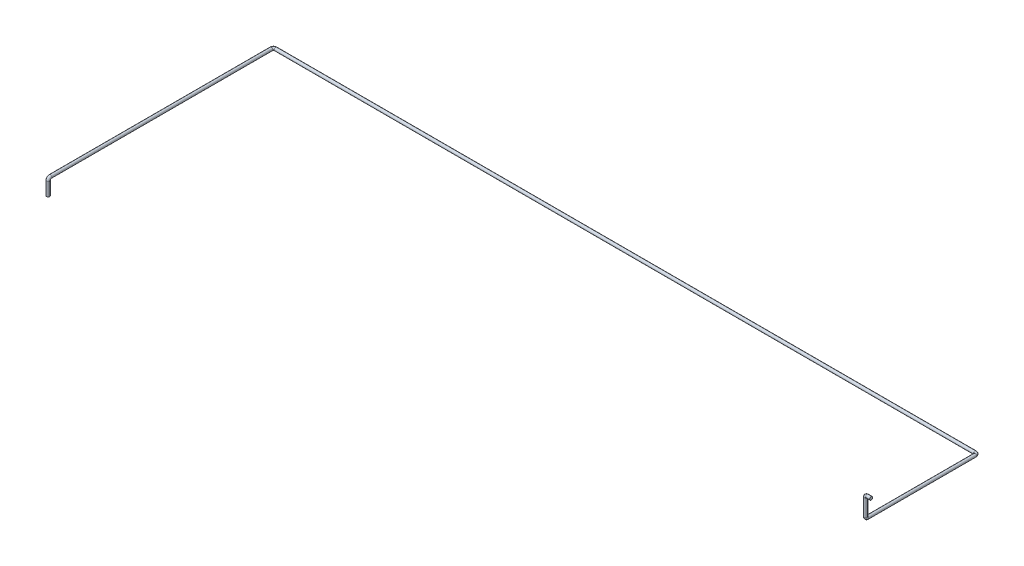
ISO-10303-21;
HEADER;
FILE_DESCRIPTION(('STEP AP214'),'2;1');
FILE_NAME('part.step','',(''),(''),'','','');
FILE_SCHEMA(('AUTOMOTIVE_DESIGN { 1 0 10303 214 1 1 1 1 }'));
ENDSEC;
DATA;
#1=APPLICATION_CONTEXT('core data for automotive mechanical design processes');
#2=APPLICATION_PROTOCOL_DEFINITION('international standard','automotive_design',2000,#1);
#3=PRODUCT_CONTEXT('',#1,'mechanical');
#4=PRODUCT('Part','Part','',(#3));
#5=PRODUCT_RELATED_PRODUCT_CATEGORY('part','',(#4));
#6=PRODUCT_DEFINITION_FORMATION('','',#4);
#7=PRODUCT_DEFINITION_CONTEXT('part definition',#1,'design');
#8=PRODUCT_DEFINITION('design','',#6,#7);
#9=PRODUCT_DEFINITION_SHAPE('','',#8);
#10=(LENGTH_UNIT() NAMED_UNIT(*) SI_UNIT(.MILLI.,.METRE.));
#11=(NAMED_UNIT(*) PLANE_ANGLE_UNIT() SI_UNIT($,.RADIAN.));
#12=(NAMED_UNIT(*) SI_UNIT($,.STERADIAN.) SOLID_ANGLE_UNIT());
#13=UNCERTAINTY_MEASURE_WITH_UNIT(LENGTH_MEASURE(1.E-05),#10,'distance_accuracy_value','');
#14=(GEOMETRIC_REPRESENTATION_CONTEXT(3) GLOBAL_UNCERTAINTY_ASSIGNED_CONTEXT((#13)) GLOBAL_UNIT_ASSIGNED_CONTEXT((#10,
#11,#12)) REPRESENTATION_CONTEXT('',''));
#15=CARTESIAN_POINT('',(0.,0.,0.));
#16=DIRECTION('',(0.,0.,1.));
#17=DIRECTION('',(1.,0.,0.));
#18=AXIS2_PLACEMENT_3D('',#15,#16,#17);
#19=CARTESIAN_POINT('',(0.,0.,0.));
#20=DIRECTION('',(1.,0.,0.));
#21=DIRECTION('',(0.,0.,-1.));
#22=AXIS2_PLACEMENT_3D('',#19,#20,#21);
#23=PLANE('',#22);
#24=CARTESIAN_POINT('',(0.,0.,0.));
#25=DIRECTION('',(1.,0.,0.));
#26=DIRECTION('',(0.,0.,-1.));
#27=AXIS2_PLACEMENT_3D('',#24,#25,#26);
#28=CIRCLE('',#27,13.7);
#29=CARTESIAN_POINT('',(0.,0.,-13.7));
#30=VERTEX_POINT('',#29);
#31=EDGE_CURVE('E47',#30,#30,#28,.T.);
#32=ORIENTED_EDGE('',*,*,#31,.T.);
#33=EDGE_LOOP('',(#32));
#34=FACE_BOUND('',#33,.T.);
#35=ADVANCED_FACE('F35',(#34),#23,.T.);
#36=CARTESIAN_POINT('',(-6360.,-320.,1020.));
#37=DIRECTION('',(0.,1.,0.));
#38=DIRECTION('',(0.,0.,1.));
#39=AXIS2_PLACEMENT_3D('',#36,#37,#38);
#40=PLANE('',#39);
#41=CARTESIAN_POINT('',(-6360.,-320.,1020.));
#42=DIRECTION('',(0.,1.,0.));
#43=DIRECTION('',(0.,0.,1.));
#44=AXIS2_PLACEMENT_3D('',#41,#42,#43);
#45=CIRCLE('',#44,13.7);
#46=CARTESIAN_POINT('',(-6360.,-320.,1033.7));
#47=VERTEX_POINT('',#46);
#48=EDGE_CURVE('E11',#47,#47,#45,.T.);
#49=ORIENTED_EDGE('',*,*,#48,.F.);
#50=EDGE_LOOP('',(#49));
#51=FACE_BOUND('',#50,.T.);
#52=ADVANCED_FACE('F53',(#51),#40,.F.);
#53=CARTESIAN_POINT('',(0.,0.,0.));
#54=DIRECTION('',(-1.,0.,0.));
#55=DIRECTION('',(0.,0.,1.));
#56=AXIS2_PLACEMENT_3D('',#53,#54,#55);
#57=CYLINDRICAL_SURFACE('',#56,13.7);
#58=CARTESIAN_POINT('',(-36.,0.,0.));
#59=DIRECTION('',(1.,0.,0.));
#60=DIRECTION('',(0.,0.,-1.));
#61=AXIS2_PLACEMENT_3D('',#58,#59,#60);
#62=CIRCLE('',#61,13.7);
#63=CARTESIAN_POINT('',(-36.,13.7,0.));
#64=VERTEX_POINT('',#63);
#65=EDGE_CURVE('E111',#64,#64,#62,.T.);
#66=ORIENTED_EDGE('',*,*,#65,.T.);
#67=EDGE_LOOP('',(#66));
#68=FACE_BOUND('',#67,.T.);
#69=ORIENTED_EDGE('',*,*,#31,.F.);
#70=EDGE_LOOP('',(#69));
#71=FACE_BOUND('',#70,.T.);
#72=ADVANCED_FACE('F55',(#68,#71),#57,.T.);
#73=CARTESIAN_POINT('',(-36.,-14.,0.));
#74=DIRECTION('',(0.,0.,1.));
#75=DIRECTION('',(1.,0.,0.));
#76=AXIS2_PLACEMENT_3D('',#73,#74,#75);
#77=TOROIDAL_SURFACE('',#76,14.,13.7);
#78=CARTESIAN_POINT('',(-50.,-14.,0.));
#79=DIRECTION('',(0.,1.,0.));
#80=DIRECTION('',(0.,0.,-1.));
#81=AXIS2_PLACEMENT_3D('',#78,#79,#80);
#82=CIRCLE('',#81,13.7);
#83=CARTESIAN_POINT('',(-63.7,-14.,0.));
#84=VERTEX_POINT('',#83);
#85=EDGE_CURVE('E108',#84,#84,#82,.T.);
#86=CARTESIAN_POINT('',(-36.,-14.,0.));
#87=DIRECTION('',(0.,0.,1.));
#88=DIRECTION('',(1.,0.,0.));
#89=AXIS2_PLACEMENT_3D('',#86,#87,#88);
#90=CIRCLE('',#89,27.7);
#91=EDGE_CURVE('',#64,#84,#90,.T.);
#92=ORIENTED_EDGE('',*,*,#65,.F.);
#93=ORIENTED_EDGE('',*,*,#85,.T.);
#94=ORIENTED_EDGE('',*,*,#91,.T.);
#95=ORIENTED_EDGE('',*,*,#91,.F.);
#96=EDGE_LOOP('',(#92,#94,#93,#95));
#97=FACE_BOUND('',#96,.T.);
#98=ADVANCED_FACE('F60',(#97),#77,.T.);
#99=CARTESIAN_POINT('',(-50.,-14.,0.));
#100=DIRECTION('',(0.,-1.,0.));
#101=DIRECTION('',(0.,0.,-1.));
#102=AXIS2_PLACEMENT_3D('',#99,#100,#101);
#103=CYLINDRICAL_SURFACE('',#102,13.7);
#104=CARTESIAN_POINT('',(-50.,-166.,0.));
#105=DIRECTION('',(0.,1.,0.));
#106=DIRECTION('',(0.,0.,-1.));
#107=AXIS2_PLACEMENT_3D('',#104,#105,#106);
#108=CIRCLE('',#107,13.7);
#109=CARTESIAN_POINT('',(-50.,-166.,13.7));
#110=VERTEX_POINT('',#109);
#111=EDGE_CURVE('E113',#110,#110,#108,.T.);
#112=ORIENTED_EDGE('',*,*,#111,.T.);
#113=EDGE_LOOP('',(#112));
#114=FACE_BOUND('',#113,.T.);
#115=ORIENTED_EDGE('',*,*,#85,.F.);
#116=EDGE_LOOP('',(#115));
#117=FACE_BOUND('',#116,.T.);
#118=ADVANCED_FACE('F96',(#114,#117),#103,.T.);
#119=CARTESIAN_POINT('',(-50.,-166.,-14.));
#120=DIRECTION('',(1.,0.,0.));
#121=DIRECTION('',(0.,0.,-1.));
#122=AXIS2_PLACEMENT_3D('',#119,#120,#121);
#123=TOROIDAL_SURFACE('',#122,14.,13.7);
#124=CARTESIAN_POINT('',(-50.,-180.,-14.));
#125=DIRECTION('',(0.,0.,1.));
#126=DIRECTION('',(0.,1.,0.));
#127=AXIS2_PLACEMENT_3D('',#124,#125,#126);
#128=CIRCLE('',#127,13.7);
#129=CARTESIAN_POINT('',(-50.,-193.7,-14.));
#130=VERTEX_POINT('',#129);
#131=EDGE_CURVE('E119',#130,#130,#128,.T.);
#132=CARTESIAN_POINT('',(-50.,-166.,-14.));
#133=DIRECTION('',(1.,0.,0.));
#134=DIRECTION('',(0.,0.,-1.));
#135=AXIS2_PLACEMENT_3D('',#132,#133,#134);
#136=CIRCLE('',#135,27.7);
#137=EDGE_CURVE('',#110,#130,#136,.T.);
#138=ORIENTED_EDGE('',*,*,#111,.F.);
#139=ORIENTED_EDGE('',*,*,#131,.T.);
#140=ORIENTED_EDGE('',*,*,#137,.T.);
#141=ORIENTED_EDGE('',*,*,#137,.F.);
#142=EDGE_LOOP('',(#138,#140,#139,#141));
#143=FACE_BOUND('',#142,.T.);
#144=ADVANCED_FACE('F92',(#143),#123,.T.);
#145=CARTESIAN_POINT('',(-50.,-180.,-14.));
#146=DIRECTION('',(0.,0.,-1.));
#147=DIRECTION('',(0.,1.,0.));
#148=AXIS2_PLACEMENT_3D('',#145,#146,#147);
#149=CYLINDRICAL_SURFACE('',#148,13.7);
#150=CARTESIAN_POINT('',(-50.,-180.,-980.));
#151=DIRECTION('',(0.,0.,1.));
#152=DIRECTION('',(0.,1.,0.));
#153=AXIS2_PLACEMENT_3D('',#150,#151,#152);
#154=CIRCLE('',#153,13.7);
#155=CARTESIAN_POINT('',(-36.3,-180.,-980.));
#156=VERTEX_POINT('',#155);
#157=EDGE_CURVE('E122',#156,#156,#154,.T.);
#158=ORIENTED_EDGE('',*,*,#157,.T.);
#159=EDGE_LOOP('',(#158));
#160=FACE_BOUND('',#159,.T.);
#161=ORIENTED_EDGE('',*,*,#131,.F.);
#162=EDGE_LOOP('',(#161));
#163=FACE_BOUND('',#162,.T.);
#164=ADVANCED_FACE('F88',(#160,#163),#149,.T.);
#165=CARTESIAN_POINT('',(-70.,-180.,-980.));
#166=DIRECTION('',(0.,1.,0.));
#167=DIRECTION('',(0.,0.,1.));
#168=AXIS2_PLACEMENT_3D('',#165,#166,#167);
#169=TOROIDAL_SURFACE('',#168,20.,13.7);
#170=CARTESIAN_POINT('',(-70.,-180.,-1000.));
#171=DIRECTION('',(1.,0.,0.));
#172=DIRECTION('',(0.,1.,0.));
#173=AXIS2_PLACEMENT_3D('',#170,#171,#172);
#174=CIRCLE('',#173,13.7);
#175=CARTESIAN_POINT('',(-70.,-180.,-1013.7));
#176=VERTEX_POINT('',#175);
#177=EDGE_CURVE('E125',#176,#176,#174,.T.);
#178=CARTESIAN_POINT('',(-70.,-180.,-980.));
#179=DIRECTION('',(0.,1.,0.));
#180=DIRECTION('',(0.,0.,1.));
#181=AXIS2_PLACEMENT_3D('',#178,#179,#180);
#182=CIRCLE('',#181,33.7);
#183=EDGE_CURVE('',#156,#176,#182,.T.);
#184=ORIENTED_EDGE('',*,*,#157,.F.);
#185=ORIENTED_EDGE('',*,*,#177,.T.);
#186=ORIENTED_EDGE('',*,*,#183,.T.);
#187=ORIENTED_EDGE('',*,*,#183,.F.);
#188=EDGE_LOOP('',(#184,#186,#185,#187));
#189=FACE_BOUND('',#188,.T.);
#190=ADVANCED_FACE('F84',(#189),#169,.T.);
#191=CARTESIAN_POINT('',(-70.,-180.,-1000.));
#192=DIRECTION('',(-1.,0.,0.));
#193=DIRECTION('',(0.,0.,1.));
#194=AXIS2_PLACEMENT_3D('',#191,#192,#193);
#195=CYLINDRICAL_SURFACE('',#194,13.7);
#196=CARTESIAN_POINT('',(-6340.,-180.,-1000.));
#197=DIRECTION('',(1.,0.,0.));
#198=DIRECTION('',(0.,1.,0.));
#199=AXIS2_PLACEMENT_3D('',#196,#197,#198);
#200=CIRCLE('',#199,13.7);
#201=CARTESIAN_POINT('',(-6340.,-180.,-1013.7));
#202=VERTEX_POINT('',#201);
#203=EDGE_CURVE('E128',#202,#202,#200,.T.);
#204=ORIENTED_EDGE('',*,*,#203,.T.);
#205=EDGE_LOOP('',(#204));
#206=FACE_BOUND('',#205,.T.);
#207=ORIENTED_EDGE('',*,*,#177,.F.);
#208=EDGE_LOOP('',(#207));
#209=FACE_BOUND('',#208,.T.);
#210=ADVANCED_FACE('F80',(#206,#209),#195,.T.);
#211=CARTESIAN_POINT('',(-6340.,-180.,-980.));
#212=DIRECTION('',(0.,1.,0.));
#213=DIRECTION('',(0.,0.,1.));
#214=AXIS2_PLACEMENT_3D('',#211,#212,#213);
#215=TOROIDAL_SURFACE('',#214,19.9999999999998,13.7);
#216=CARTESIAN_POINT('',(-6360.,-180.,-980.));
#217=DIRECTION('',(0.,0.,-1.));
#218=DIRECTION('',(0.,1.,0.));
#219=AXIS2_PLACEMENT_3D('',#216,#217,#218);
#220=CIRCLE('',#219,13.7);
#221=CARTESIAN_POINT('',(-6373.7,-180.,-980.));
#222=VERTEX_POINT('',#221);
#223=EDGE_CURVE('E131',#222,#222,#220,.T.);
#224=CARTESIAN_POINT('',(-6340.,-180.,-980.));
#225=DIRECTION('',(0.,1.,0.));
#226=DIRECTION('',(0.,0.,1.));
#227=AXIS2_PLACEMENT_3D('',#224,#225,#226);
#228=CIRCLE('',#227,33.6999999999998);
#229=EDGE_CURVE('',#202,#222,#228,.T.);
#230=ORIENTED_EDGE('',*,*,#203,.F.);
#231=ORIENTED_EDGE('',*,*,#223,.T.);
#232=ORIENTED_EDGE('',*,*,#229,.T.);
#233=ORIENTED_EDGE('',*,*,#229,.F.);
#234=EDGE_LOOP('',(#230,#232,#231,#233));
#235=FACE_BOUND('',#234,.T.);
#236=ADVANCED_FACE('F76',(#235),#215,.T.);
#237=CARTESIAN_POINT('',(-6360.,-180.,-980.));
#238=DIRECTION('',(0.,0.,1.));
#239=DIRECTION('',(1.,0.,0.));
#240=AXIS2_PLACEMENT_3D('',#237,#238,#239);
#241=CYLINDRICAL_SURFACE('',#240,13.7);
#242=CARTESIAN_POINT('',(-6360.,-180.,1000.));
#243=DIRECTION('',(0.,0.,-1.));
#244=DIRECTION('',(0.,1.,0.));
#245=AXIS2_PLACEMENT_3D('',#242,#243,#244);
#246=CIRCLE('',#245,13.7);
#247=CARTESIAN_POINT('',(-6360.,-166.3,1000.));
#248=VERTEX_POINT('',#247);
#249=EDGE_CURVE('E134',#248,#248,#246,.T.);
#250=ORIENTED_EDGE('',*,*,#249,.T.);
#251=EDGE_LOOP('',(#250));
#252=FACE_BOUND('',#251,.T.);
#253=ORIENTED_EDGE('',*,*,#223,.F.);
#254=EDGE_LOOP('',(#253));
#255=FACE_BOUND('',#254,.T.);
#256=ADVANCED_FACE('F70',(#252,#255),#241,.T.);
#257=CARTESIAN_POINT('',(-6360.,-200.,1000.));
#258=DIRECTION('',(1.,0.,0.));
#259=DIRECTION('',(0.,0.,-1.));
#260=AXIS2_PLACEMENT_3D('',#257,#258,#259);
#261=TOROIDAL_SURFACE('',#260,20.,13.7);
#262=CARTESIAN_POINT('',(-6360.,-200.,1020.));
#263=DIRECTION('',(0.,1.,0.));
#264=DIRECTION('',(0.,0.,1.));
#265=AXIS2_PLACEMENT_3D('',#262,#263,#264);
#266=CIRCLE('',#265,13.7);
#267=CARTESIAN_POINT('',(-6360.,-200.,1033.7));
#268=VERTEX_POINT('',#267);
#269=EDGE_CURVE('E42',#268,#268,#266,.T.);
#270=CARTESIAN_POINT('',(-6360.,-200.,1000.));
#271=DIRECTION('',(1.,0.,0.));
#272=DIRECTION('',(0.,0.,-1.));
#273=AXIS2_PLACEMENT_3D('',#270,#271,#272);
#274=CIRCLE('',#273,33.7);
#275=EDGE_CURVE('',#248,#268,#274,.T.);
#276=ORIENTED_EDGE('',*,*,#249,.F.);
#277=ORIENTED_EDGE('',*,*,#269,.T.);
#278=ORIENTED_EDGE('',*,*,#275,.T.);
#279=ORIENTED_EDGE('',*,*,#275,.F.);
#280=EDGE_LOOP('',(#276,#278,#277,#279));
#281=FACE_BOUND('',#280,.T.);
#282=ADVANCED_FACE('F66',(#281),#261,.T.);
#283=CARTESIAN_POINT('',(-6360.,-200.,1020.));
#284=DIRECTION('',(0.,-1.,0.));
#285=DIRECTION('',(0.,0.,-1.));
#286=AXIS2_PLACEMENT_3D('',#283,#284,#285);
#287=CYLINDRICAL_SURFACE('',#286,13.7);
#288=ORIENTED_EDGE('',*,*,#48,.T.);
#289=EDGE_LOOP('',(#288));
#290=FACE_BOUND('',#289,.T.);
#291=ORIENTED_EDGE('',*,*,#269,.F.);
#292=EDGE_LOOP('',(#291));
#293=FACE_BOUND('',#292,.T.);
#294=ADVANCED_FACE('F50',(#290,#293),#287,.T.);
#295=CLOSED_SHELL('',(#35,#52,#72,#98,#118,#144,#164,#190,#210,#236,#256,#282,#294));
#296=MANIFOLD_SOLID_BREP('B2',#295);
#297=ADVANCED_BREP_SHAPE_REPRESENTATION('',(#18,#296),#14);
#298=SHAPE_DEFINITION_REPRESENTATION(#9,#297);
ENDSEC;
END-ISO-10303-21;
